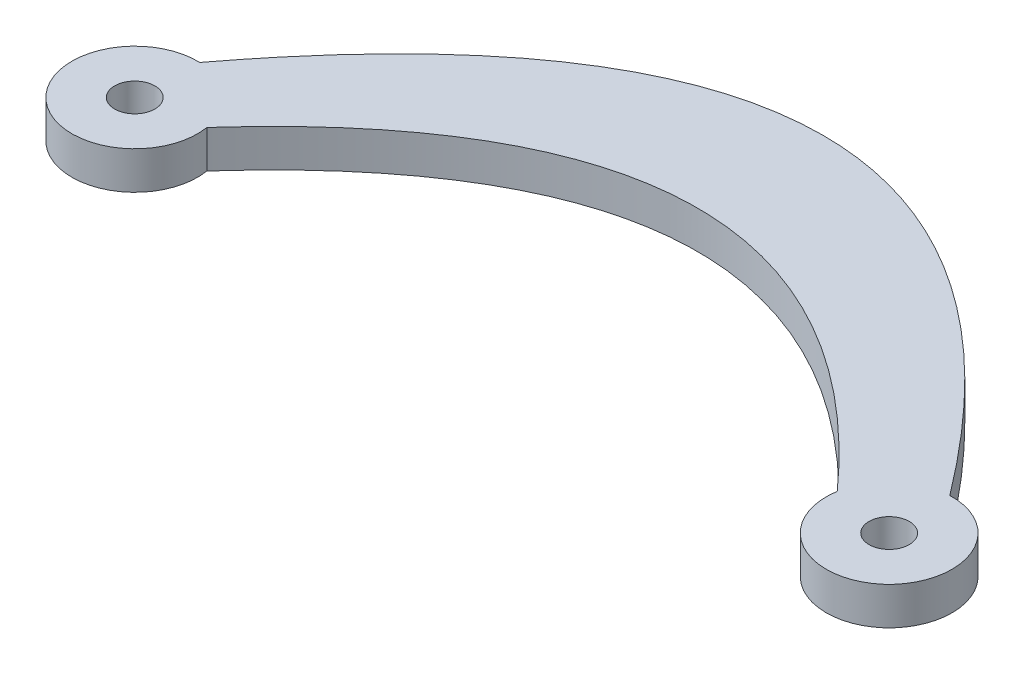
ISO-10303-21;
HEADER;
FILE_DESCRIPTION(('STEP AP214'),'2;1');
FILE_NAME('part.step','',(''),(''),'','','');
FILE_SCHEMA(('AUTOMOTIVE_DESIGN { 1 0 10303 214 1 1 1 1 }'));
ENDSEC;
DATA;
#1=APPLICATION_CONTEXT('core data for automotive mechanical design processes');
#2=APPLICATION_PROTOCOL_DEFINITION('international standard','automotive_design',2000,#1);
#3=PRODUCT_CONTEXT('',#1,'mechanical');
#4=PRODUCT('Part','Part','',(#3));
#5=PRODUCT_RELATED_PRODUCT_CATEGORY('part','',(#4));
#6=PRODUCT_DEFINITION_FORMATION('','',#4);
#7=PRODUCT_DEFINITION_CONTEXT('part definition',#1,'design');
#8=PRODUCT_DEFINITION('design','',#6,#7);
#9=PRODUCT_DEFINITION_SHAPE('','',#8);
#10=(LENGTH_UNIT() NAMED_UNIT(*) SI_UNIT(.MILLI.,.METRE.));
#11=(NAMED_UNIT(*) PLANE_ANGLE_UNIT() SI_UNIT($,.RADIAN.));
#12=(NAMED_UNIT(*) SI_UNIT($,.STERADIAN.) SOLID_ANGLE_UNIT());
#13=UNCERTAINTY_MEASURE_WITH_UNIT(LENGTH_MEASURE(1.E-05),#10,'distance_accuracy_value','');
#14=(GEOMETRIC_REPRESENTATION_CONTEXT(3) GLOBAL_UNCERTAINTY_ASSIGNED_CONTEXT((#13)) GLOBAL_UNIT_ASSIGNED_CONTEXT((#10,
#11,#12)) REPRESENTATION_CONTEXT('',''));
#15=CARTESIAN_POINT('',(0.,0.,0.));
#16=DIRECTION('',(0.,0.,1.));
#17=DIRECTION('',(1.,0.,0.));
#18=AXIS2_PLACEMENT_3D('',#15,#16,#17);
#19=CARTESIAN_POINT('',(-30.0000000002537,3.,-20.));
#20=DIRECTION('',(0.,1.,0.));
#21=DIRECTION('',(0.,0.,1.));
#22=AXIS2_PLACEMENT_3D('',#19,#20,#21);
#23=PLANE('',#22);
#24=CARTESIAN_POINT('',(-60.,3.,-5.23346603301301));
#25=DIRECTION('',(0.,1.,0.));
#26=DIRECTION('',(0.,0.,1.));
#27=AXIS2_PLACEMENT_3D('',#24,#25,#26);
#28=CIRCLE('',#27,1.6);
#29=CARTESIAN_POINT('',(-60.,3.,-3.63346603301301));
#30=VERTEX_POINT('',#29);
#31=EDGE_CURVE('E145',#30,#30,#28,.T.);
#32=ORIENTED_EDGE('',*,*,#31,.F.);
#33=EDGE_LOOP('',(#32));
#34=FACE_BOUND('',#33,.T.);
#35=CARTESIAN_POINT('',(-55.0652383234947,3.,-6.03852950634603));
#36=CARTESIAN_POINT('',(-46.7101588823171,3.,-15.3461765021313));
#37=CARTESIAN_POINT('',(-30.0000000004142,3.,-24.6538234980642));
#38=CARTESIAN_POINT('',(-13.289841117531,3.,-15.3461765017402));
#39=CARTESIAN_POINT('',(-4.93476167650591,3.,-6.03852950634205));
#40=B_SPLINE_CURVE_WITH_KNOTS('',3,(#35,#36,#37,#38,#39),.UNSPECIFIED.,.F.,.F.,(4,1,4),
(0.0822460279411161,0.5,0.917753972050428),.UNSPECIFIED.);
#41=CARTESIAN_POINT('',(-55.0652383234947,3.,-6.03852950634603));
#42=VERTEX_POINT('',#41);
#43=CARTESIAN_POINT('',(-4.9347616765059,3.,-6.03852950634205));
#44=VERTEX_POINT('',#43);
#45=EDGE_CURVE('E87',#42,#44,#40,.T.);
#46=ORIENTED_EDGE('',*,*,#45,.T.);
#47=CARTESIAN_POINT('',(0.,3.,-5.23346603301302));
#48=DIRECTION('',(0.,1.,0.));
#49=DIRECTION('',(0.,0.,-1.));
#50=AXIS2_PLACEMENT_3D('',#47,#48,#49);
#51=CIRCLE('',#50,4.99999999999999);
#52=CARTESIAN_POINT('',(-0.173345998430555,3.,-10.2304602460203));
#53=VERTEX_POINT('',#52);
#54=EDGE_CURVE('E82',#44,#53,#51,.T.);
#55=ORIENTED_EDGE('',*,*,#54,.T.);
#56=CARTESIAN_POINT('',(-0.173345998430555,3.,-10.2304602460203));
#57=CARTESIAN_POINT('',(-10.1155639989583,3.,-23.4101534153402));
#58=CARTESIAN_POINT('',(-29.9999999999984,3.,-36.5898465846559));
#59=CARTESIAN_POINT('',(-49.8844360010448,3.,-23.410153415348));
#60=CARTESIAN_POINT('',(-59.8266540015696,3.,-10.2304602460203));
#61=B_SPLINE_CURVE_WITH_KNOTS('',3,(#56,#57,#58,#59,#60),.UNSPECIFIED.,.F.,.F.,(4,1,4),
(0.00288909997376387,0.5,0.997110900026237),.UNSPECIFIED.);
#62=CARTESIAN_POINT('',(-59.8266540015696,3.,-10.2304602460203));
#63=VERTEX_POINT('',#62);
#64=EDGE_CURVE('E85',#53,#63,#61,.T.);
#65=ORIENTED_EDGE('',*,*,#64,.T.);
#66=CARTESIAN_POINT('',(-60.,3.,-5.23346603301301));
#67=DIRECTION('',(0.,1.,0.));
#68=DIRECTION('',(0.,0.,1.));
#69=AXIS2_PLACEMENT_3D('',#66,#67,#68);
#70=CIRCLE('',#69,5.);
#71=EDGE_CURVE('E52',#63,#42,#70,.T.);
#72=ORIENTED_EDGE('',*,*,#71,.T.);
#73=EDGE_LOOP('',(#46,#55,#65,#72));
#74=FACE_BOUND('',#73,.T.);
#75=CARTESIAN_POINT('',(0.,3.,-5.23346603301302));
#76=DIRECTION('',(0.,1.,0.));
#77=DIRECTION('',(0.,0.,-1.));
#78=AXIS2_PLACEMENT_3D('',#75,#76,#77);
#79=CIRCLE('',#78,1.6);
#80=CARTESIAN_POINT('',(0.,3.,-6.83346603301302));
#81=VERTEX_POINT('',#80);
#82=EDGE_CURVE('E136',#81,#81,#79,.T.);
#83=ORIENTED_EDGE('',*,*,#82,.F.);
#84=EDGE_LOOP('',(#83));
#85=FACE_BOUND('',#84,.T.);
#86=ADVANCED_FACE('F34',(#34,#74,#85),#23,.T.);
#87=CARTESIAN_POINT('',(-30.0000000002537,0.,-20.));
#88=DIRECTION('',(0.,1.,0.));
#89=DIRECTION('',(0.,0.,1.));
#90=AXIS2_PLACEMENT_3D('',#87,#88,#89);
#91=PLANE('',#90);
#92=CARTESIAN_POINT('',(-55.0652383234947,0.,-6.03852950634603));
#93=CARTESIAN_POINT('',(-46.7101588823171,0.,-15.3461765021313));
#94=CARTESIAN_POINT('',(-30.0000000004142,0.,-24.6538234980642));
#95=CARTESIAN_POINT('',(-13.289841117531,0.,-15.3461765017402));
#96=CARTESIAN_POINT('',(-4.93476167650591,0.,-6.03852950634205));
#97=B_SPLINE_CURVE_WITH_KNOTS('',3,(#92,#93,#94,#95,#96),.UNSPECIFIED.,.F.,.F.,(4,1,4),
(0.0822460279411161,0.5,0.917753972050428),.UNSPECIFIED.);
#98=CARTESIAN_POINT('',(-55.0652383234947,0.,-6.03852950634603));
#99=VERTEX_POINT('',#98);
#100=CARTESIAN_POINT('',(-4.9347616765059,0.,-6.03852950634205));
#101=VERTEX_POINT('',#100);
#102=EDGE_CURVE('E148',#99,#101,#97,.T.);
#103=ORIENTED_EDGE('',*,*,#102,.F.);
#104=CARTESIAN_POINT('',(-60.,0.,-5.23346603301301));
#105=DIRECTION('',(0.,1.,0.));
#106=DIRECTION('',(0.,0.,1.));
#107=AXIS2_PLACEMENT_3D('',#104,#105,#106);
#108=CIRCLE('',#107,5.);
#109=CARTESIAN_POINT('',(-59.8266540015696,0.,-10.2304602460203));
#110=VERTEX_POINT('',#109);
#111=EDGE_CURVE('E75',#110,#99,#108,.T.);
#112=ORIENTED_EDGE('',*,*,#111,.F.);
#113=CARTESIAN_POINT('',(-0.173345998430555,0.,-10.2304602460203));
#114=CARTESIAN_POINT('',(-10.1155639989583,0.,-23.4101534153402));
#115=CARTESIAN_POINT('',(-29.9999999999984,0.,-36.5898465846559));
#116=CARTESIAN_POINT('',(-49.8844360010448,0.,-23.410153415348));
#117=CARTESIAN_POINT('',(-59.8266540015696,0.,-10.2304602460203));
#118=B_SPLINE_CURVE_WITH_KNOTS('',3,(#113,#114,#115,#116,#117),.UNSPECIFIED.,.F.,.F.,(4,1,4),
(0.00288909997376387,0.5,0.997110900026237),.UNSPECIFIED.);
#119=CARTESIAN_POINT('',(-0.173345998430555,0.,-10.2304602460203));
#120=VERTEX_POINT('',#119);
#121=EDGE_CURVE('E69',#120,#110,#118,.T.);
#122=ORIENTED_EDGE('',*,*,#121,.F.);
#123=CARTESIAN_POINT('',(0.,0.,-5.23346603301302));
#124=DIRECTION('',(0.,1.,0.));
#125=DIRECTION('',(0.,0.,-1.));
#126=AXIS2_PLACEMENT_3D('',#123,#124,#125);
#127=CIRCLE('',#126,4.99999999999999);
#128=EDGE_CURVE('E91',#101,#120,#127,.T.);
#129=ORIENTED_EDGE('',*,*,#128,.F.);
#130=EDGE_LOOP('',(#103,#112,#122,#129));
#131=FACE_BOUND('',#130,.T.);
#132=CARTESIAN_POINT('',(-60.,0.,-5.23346603301301));
#133=DIRECTION('',(0.,1.,0.));
#134=DIRECTION('',(0.,0.,1.));
#135=AXIS2_PLACEMENT_3D('',#132,#133,#134);
#136=CIRCLE('',#135,1.6);
#137=CARTESIAN_POINT('',(-60.,0.,-3.63346603301301));
#138=VERTEX_POINT('',#137);
#139=EDGE_CURVE('E142',#138,#138,#136,.T.);
#140=ORIENTED_EDGE('',*,*,#139,.T.);
#141=EDGE_LOOP('',(#140));
#142=FACE_BOUND('',#141,.T.);
#143=CARTESIAN_POINT('',(0.,0.,-5.23346603301302));
#144=DIRECTION('',(0.,1.,0.));
#145=DIRECTION('',(0.,0.,-1.));
#146=AXIS2_PLACEMENT_3D('',#143,#144,#145);
#147=CIRCLE('',#146,1.6);
#148=CARTESIAN_POINT('',(0.,0.,-6.83346603301302));
#149=VERTEX_POINT('',#148);
#150=EDGE_CURVE('E139',#149,#149,#147,.T.);
#151=ORIENTED_EDGE('',*,*,#150,.T.);
#152=EDGE_LOOP('',(#151));
#153=FACE_BOUND('',#152,.T.);
#154=ADVANCED_FACE('F113',(#131,#142,#153),#91,.F.);
#155=DIRECTION('',(0.,-1.,0.));
#156=VECTOR('',#155,1.);
#157=SURFACE_OF_LINEAR_EXTRUSION('',#40,#156);
#158=ORIENTED_EDGE('',*,*,#102,.T.);
#159=DIRECTION('',(0.,-1.,0.));
#160=VECTOR('',#159,1.);
#161=CARTESIAN_POINT('',(-4.9347616765059,3.,-6.03852950634205));
#162=LINE('',#161,#160);
#163=EDGE_CURVE('E11',#44,#101,#162,.T.);
#164=ORIENTED_EDGE('',*,*,#163,.F.);
#165=ORIENTED_EDGE('',*,*,#45,.F.);
#166=DIRECTION('',(0.,-1.,0.));
#167=VECTOR('',#166,1.);
#168=CARTESIAN_POINT('',(-55.0652383234947,3.,-6.03852950634603));
#169=LINE('',#168,#167);
#170=EDGE_CURVE('E95',#42,#99,#169,.T.);
#171=ORIENTED_EDGE('',*,*,#170,.T.);
#172=EDGE_LOOP('',(#158,#164,#165,#171));
#173=FACE_BOUND('',#172,.T.);
#174=ADVANCED_FACE('F36',(#173),#157,.F.);
#175=CARTESIAN_POINT('',(0.,3.,-5.23346603301302));
#176=DIRECTION('',(0.,-1.,0.));
#177=DIRECTION('',(0.,0.,-1.));
#178=AXIS2_PLACEMENT_3D('',#175,#176,#177);
#179=CYLINDRICAL_SURFACE('',#178,4.99999999999999);
#180=ORIENTED_EDGE('',*,*,#128,.T.);
#181=DIRECTION('',(0.,-1.,0.));
#182=VECTOR('',#181,1.);
#183=CARTESIAN_POINT('',(-0.173345998430555,3.,-10.2304602460203));
#184=LINE('',#183,#182);
#185=EDGE_CURVE('E44',#53,#120,#184,.T.);
#186=ORIENTED_EDGE('',*,*,#185,.F.);
#187=ORIENTED_EDGE('',*,*,#54,.F.);
#188=ORIENTED_EDGE('',*,*,#163,.T.);
#189=EDGE_LOOP('',(#180,#186,#187,#188));
#190=FACE_BOUND('',#189,.T.);
#191=ADVANCED_FACE('F90',(#190),#179,.T.);
#192=DIRECTION('',(0.,-1.,0.));
#193=VECTOR('',#192,1.);
#194=SURFACE_OF_LINEAR_EXTRUSION('',#61,#193);
#195=ORIENTED_EDGE('',*,*,#121,.T.);
#196=DIRECTION('',(0.,-1.,0.));
#197=VECTOR('',#196,1.);
#198=CARTESIAN_POINT('',(-59.8266540015696,3.,-10.2304602460203));
#199=LINE('',#198,#197);
#200=EDGE_CURVE('E92',#63,#110,#199,.T.);
#201=ORIENTED_EDGE('',*,*,#200,.F.);
#202=ORIENTED_EDGE('',*,*,#64,.F.);
#203=ORIENTED_EDGE('',*,*,#185,.T.);
#204=EDGE_LOOP('',(#195,#201,#202,#203));
#205=FACE_BOUND('',#204,.T.);
#206=ADVANCED_FACE('F93',(#205),#194,.F.);
#207=CARTESIAN_POINT('',(-60.,3.,-5.23346603301301));
#208=DIRECTION('',(0.,-1.,0.));
#209=DIRECTION('',(0.,0.,-1.));
#210=AXIS2_PLACEMENT_3D('',#207,#208,#209);
#211=CYLINDRICAL_SURFACE('',#210,5.);
#212=ORIENTED_EDGE('',*,*,#111,.T.);
#213=ORIENTED_EDGE('',*,*,#170,.F.);
#214=ORIENTED_EDGE('',*,*,#71,.F.);
#215=ORIENTED_EDGE('',*,*,#200,.T.);
#216=EDGE_LOOP('',(#212,#213,#214,#215));
#217=FACE_BOUND('',#216,.T.);
#218=ADVANCED_FACE('F107',(#217),#211,.T.);
#219=CARTESIAN_POINT('',(-60.,3.,-5.23346603301301));
#220=DIRECTION('',(0.,-1.,0.));
#221=DIRECTION('',(0.,0.,-1.));
#222=AXIS2_PLACEMENT_3D('',#219,#220,#221);
#223=CYLINDRICAL_SURFACE('',#222,1.6);
#224=ORIENTED_EDGE('',*,*,#31,.T.);
#225=EDGE_LOOP('',(#224));
#226=FACE_BOUND('',#225,.T.);
#227=ORIENTED_EDGE('',*,*,#139,.F.);
#228=EDGE_LOOP('',(#227));
#229=FACE_BOUND('',#228,.T.);
#230=ADVANCED_FACE('F124',(#226,#229),#223,.F.);
#231=CARTESIAN_POINT('',(0.,3.,-5.23346603301302));
#232=DIRECTION('',(0.,-1.,0.));
#233=DIRECTION('',(0.,0.,-1.));
#234=AXIS2_PLACEMENT_3D('',#231,#232,#233);
#235=CYLINDRICAL_SURFACE('',#234,1.6);
#236=ORIENTED_EDGE('',*,*,#82,.T.);
#237=EDGE_LOOP('',(#236));
#238=FACE_BOUND('',#237,.T.);
#239=ORIENTED_EDGE('',*,*,#150,.F.);
#240=EDGE_LOOP('',(#239));
#241=FACE_BOUND('',#240,.T.);
#242=ADVANCED_FACE('F127',(#238,#241),#235,.F.);
#243=CLOSED_SHELL('',(#86,#154,#174,#191,#206,#218,#230,#242));
#244=MANIFOLD_SOLID_BREP('B2',#243);
#245=ADVANCED_BREP_SHAPE_REPRESENTATION('',(#18,#244),#14);
#246=SHAPE_DEFINITION_REPRESENTATION(#9,#245);
ENDSEC;
END-ISO-10303-21;
